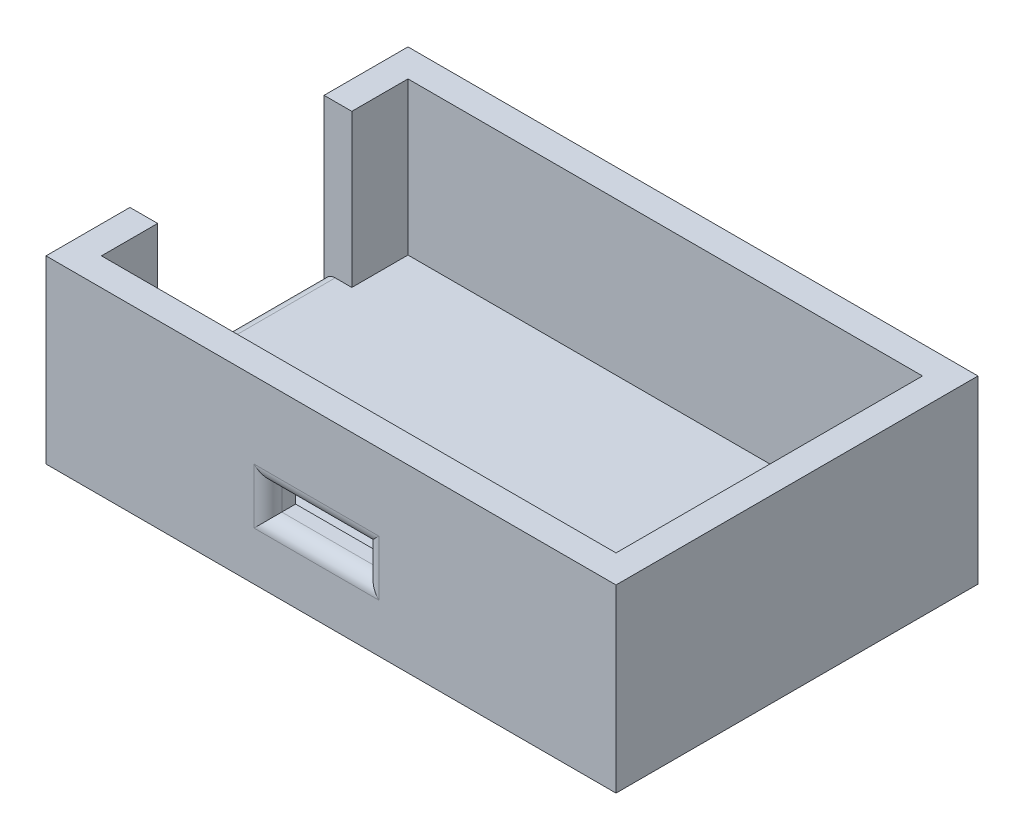
ISO-10303-21;
HEADER;
FILE_DESCRIPTION(('STEP AP214'),'2;1');
FILE_NAME('part.step','',(''),(''),'','','');
FILE_SCHEMA(('AUTOMOTIVE_DESIGN { 1 0 10303 214 1 1 1 1 }'));
ENDSEC;
DATA;
#1=APPLICATION_CONTEXT('core data for automotive mechanical design processes');
#2=APPLICATION_PROTOCOL_DEFINITION('international standard','automotive_design',2000,#1);
#3=PRODUCT_CONTEXT('',#1,'mechanical');
#4=PRODUCT('Part','Part','',(#3));
#5=PRODUCT_RELATED_PRODUCT_CATEGORY('part','',(#4));
#6=PRODUCT_DEFINITION_FORMATION('','',#4);
#7=PRODUCT_DEFINITION_CONTEXT('part definition',#1,'design');
#8=PRODUCT_DEFINITION('design','',#6,#7);
#9=PRODUCT_DEFINITION_SHAPE('','',#8);
#10=(LENGTH_UNIT() NAMED_UNIT(*) SI_UNIT(.MILLI.,.METRE.));
#11=(NAMED_UNIT(*) PLANE_ANGLE_UNIT() SI_UNIT($,.RADIAN.));
#12=(NAMED_UNIT(*) SI_UNIT($,.STERADIAN.) SOLID_ANGLE_UNIT());
#13=UNCERTAINTY_MEASURE_WITH_UNIT(LENGTH_MEASURE(1.E-05),#10,'distance_accuracy_value','');
#14=(GEOMETRIC_REPRESENTATION_CONTEXT(3) GLOBAL_UNCERTAINTY_ASSIGNED_CONTEXT((#13)) GLOBAL_UNIT_ASSIGNED_CONTEXT((#10,
#11,#12)) REPRESENTATION_CONTEXT('',''));
#15=CARTESIAN_POINT('',(0.,0.,0.));
#16=DIRECTION('',(0.,0.,1.));
#17=DIRECTION('',(1.,0.,0.));
#18=AXIS2_PLACEMENT_3D('',#15,#16,#17);
#19=CARTESIAN_POINT('',(-18.55,11.,-11.05));
#20=DIRECTION('',(1.,0.,0.));
#21=DIRECTION('',(0.,0.,-1.));
#22=AXIS2_PLACEMENT_3D('',#19,#20,#21);
#23=PLANE('',#22);
#24=DIRECTION('',(0.,-1.,0.));
#25=VECTOR('',#24,1.);
#26=CARTESIAN_POINT('',(-18.55,11.,-7.));
#27=LINE('',#26,#25);
#28=CARTESIAN_POINT('',(-18.55,11.,-7.));
#29=VERTEX_POINT('',#28);
#30=CARTESIAN_POINT('',(-18.55,0.,-7.));
#31=VERTEX_POINT('',#30);
#32=EDGE_CURVE('E213',#29,#31,#27,.T.);
#33=ORIENTED_EDGE('',*,*,#32,.T.);
#34=DIRECTION('',(0.,0.,1.));
#35=VECTOR('',#34,1.);
#36=CARTESIAN_POINT('',(-18.55,0.,-11.05));
#37=LINE('',#36,#35);
#38=CARTESIAN_POINT('',(-18.55,0.,-11.05));
#39=VERTEX_POINT('',#38);
#40=EDGE_CURVE('E237',#39,#31,#37,.T.);
#41=ORIENTED_EDGE('',*,*,#40,.F.);
#42=DIRECTION('',(0.,-1.,0.));
#43=VECTOR('',#42,1.);
#44=CARTESIAN_POINT('',(-18.55,11.,-11.05));
#45=LINE('',#44,#43);
#46=CARTESIAN_POINT('',(-18.55,11.,-11.05));
#47=VERTEX_POINT('',#46);
#48=EDGE_CURVE('E236',#47,#39,#45,.T.);
#49=ORIENTED_EDGE('',*,*,#48,.F.);
#50=DIRECTION('',(0.,0.,1.));
#51=VECTOR('',#50,1.);
#52=CARTESIAN_POINT('',(-18.55,11.,-11.05));
#53=LINE('',#52,#51);
#54=EDGE_CURVE('E225',#47,#29,#53,.T.);
#55=ORIENTED_EDGE('',*,*,#54,.T.);
#56=EDGE_LOOP('',(#33,#41,#49,#55));
#57=FACE_BOUND('',#56,.T.);
#58=ADVANCED_FACE('F36',(#57),#23,.T.);
#59=CARTESIAN_POINT('',(0.,11.,0.));
#60=DIRECTION('',(0.,-1.,0.));
#61=DIRECTION('',(0.,0.,-1.));
#62=AXIS2_PLACEMENT_3D('',#59,#60,#61);
#63=PLANE('',#62);
#64=DIRECTION('',(0.,0.,1.));
#65=VECTOR('',#64,1.);
#66=CARTESIAN_POINT('',(-20.55,11.,0.));
#67=LINE('',#66,#65);
#68=CARTESIAN_POINT('',(-20.55,11.,-13.05));
#69=VERTEX_POINT('',#68);
#70=CARTESIAN_POINT('',(-20.55,11.,-7.));
#71=VERTEX_POINT('',#70);
#72=EDGE_CURVE('E281',#69,#71,#67,.T.);
#73=ORIENTED_EDGE('',*,*,#72,.T.);
#74=DIRECTION('',(-1.,0.,0.));
#75=VECTOR('',#74,1.);
#76=CARTESIAN_POINT('',(-0.74550618523514,11.,-7.));
#77=LINE('',#76,#75);
#78=EDGE_CURVE('E206',#29,#71,#77,.T.);
#79=ORIENTED_EDGE('',*,*,#78,.F.);
#80=ORIENTED_EDGE('',*,*,#54,.F.);
#81=DIRECTION('',(-1.,0.,0.));
#82=VECTOR('',#81,1.);
#83=CARTESIAN_POINT('',(18.55,11.,-11.05));
#84=LINE('',#83,#82);
#85=CARTESIAN_POINT('',(18.55,11.,-11.05));
#86=VERTEX_POINT('',#85);
#87=EDGE_CURVE('E234',#86,#47,#84,.T.);
#88=ORIENTED_EDGE('',*,*,#87,.F.);
#89=DIRECTION('',(0.,0.,-1.));
#90=VECTOR('',#89,1.);
#91=CARTESIAN_POINT('',(18.55,11.,-11.05));
#92=LINE('',#91,#90);
#93=CARTESIAN_POINT('',(18.55,11.,11.05));
#94=VERTEX_POINT('',#93);
#95=EDGE_CURVE('E231',#94,#86,#92,.T.);
#96=ORIENTED_EDGE('',*,*,#95,.F.);
#97=DIRECTION('',(1.,0.,0.));
#98=VECTOR('',#97,1.);
#99=CARTESIAN_POINT('',(18.55,11.,11.05));
#100=LINE('',#99,#98);
#101=CARTESIAN_POINT('',(-18.55,11.,11.05));
#102=VERTEX_POINT('',#101);
#103=EDGE_CURVE('E228',#102,#94,#100,.T.);
#104=ORIENTED_EDGE('',*,*,#103,.F.);
#105=CARTESIAN_POINT('',(-18.55,11.,7.));
#106=VERTEX_POINT('',#105);
#107=EDGE_CURVE('E229',#106,#102,#53,.T.);
#108=ORIENTED_EDGE('',*,*,#107,.F.);
#109=DIRECTION('',(-1.,0.,0.));
#110=VECTOR('',#109,1.);
#111=CARTESIAN_POINT('',(-0.74550618523514,11.,7.));
#112=LINE('',#111,#110);
#113=CARTESIAN_POINT('',(-20.55,11.,7.));
#114=VERTEX_POINT('',#113);
#115=EDGE_CURVE('E211',#106,#114,#112,.T.);
#116=ORIENTED_EDGE('',*,*,#115,.T.);
#117=CARTESIAN_POINT('',(-20.55,11.,13.05));
#118=VERTEX_POINT('',#117);
#119=EDGE_CURVE('E280',#114,#118,#67,.T.);
#120=ORIENTED_EDGE('',*,*,#119,.T.);
#121=DIRECTION('',(1.,0.,0.));
#122=VECTOR('',#121,1.);
#123=CARTESIAN_POINT('',(0.,11.,13.05));
#124=LINE('',#123,#122);
#125=CARTESIAN_POINT('',(20.55,11.,13.05));
#126=VERTEX_POINT('',#125);
#127=EDGE_CURVE('E284',#118,#126,#124,.T.);
#128=ORIENTED_EDGE('',*,*,#127,.T.);
#129=DIRECTION('',(0.,0.,-1.));
#130=VECTOR('',#129,1.);
#131=CARTESIAN_POINT('',(20.55,11.,0.));
#132=LINE('',#131,#130);
#133=CARTESIAN_POINT('',(20.55,11.,-13.05));
#134=VERTEX_POINT('',#133);
#135=EDGE_CURVE('E286',#126,#134,#132,.T.);
#136=ORIENTED_EDGE('',*,*,#135,.T.);
#137=DIRECTION('',(-1.,0.,0.));
#138=VECTOR('',#137,1.);
#139=CARTESIAN_POINT('',(0.,11.,-13.05));
#140=LINE('',#139,#138);
#141=EDGE_CURVE('E270',#134,#69,#140,.T.);
#142=ORIENTED_EDGE('',*,*,#141,.T.);
#143=EDGE_LOOP('',(#73,#79,#80,#88,#96,#104,#108,#116,#120,#128,#136,#142));
#144=FACE_BOUND('',#143,.T.);
#145=ADVANCED_FACE('F326',(#144),#63,.F.);
#146=CARTESIAN_POINT('',(-20.55,11.,-11.05));
#147=DIRECTION('',(1.,0.,0.));
#148=DIRECTION('',(0.,0.,-1.));
#149=AXIS2_PLACEMENT_3D('',#146,#147,#148);
#150=PLANE('',#149);
#151=DIRECTION('',(0.,1.,0.));
#152=VECTOR('',#151,1.);
#153=CARTESIAN_POINT('',(-20.55,11.,7.));
#154=LINE('',#153,#152);
#155=CARTESIAN_POINT('',(-20.55,-0.8,7.));
#156=VERTEX_POINT('',#155);
#157=EDGE_CURVE('E51',#156,#114,#154,.T.);
#158=ORIENTED_EDGE('',*,*,#157,.F.);
#159=DIRECTION('',(0.,0.,1.));
#160=VECTOR('',#159,1.);
#161=CARTESIAN_POINT('',(-20.55,-0.8,-11.05));
#162=LINE('',#161,#160);
#163=CARTESIAN_POINT('',(-20.55,-0.8,-7.));
#164=VERTEX_POINT('',#163);
#165=EDGE_CURVE('E314',#156,#164,#162,.F.);
#166=ORIENTED_EDGE('',*,*,#165,.T.);
#167=DIRECTION('',(0.,-1.,0.));
#168=VECTOR('',#167,1.);
#169=CARTESIAN_POINT('',(-20.55,11.,-7.));
#170=LINE('',#169,#168);
#171=EDGE_CURVE('E58',#71,#164,#170,.T.);
#172=ORIENTED_EDGE('',*,*,#171,.F.);
#173=ORIENTED_EDGE('',*,*,#72,.F.);
#174=DIRECTION('',(0.,-1.,0.));
#175=VECTOR('',#174,1.);
#176=CARTESIAN_POINT('',(-20.55,11.,-13.05));
#177=LINE('',#176,#175);
#178=CARTESIAN_POINT('',(-20.55,-2.,-13.05));
#179=VERTEX_POINT('',#178);
#180=EDGE_CURVE('E266',#69,#179,#177,.T.);
#181=ORIENTED_EDGE('',*,*,#180,.T.);
#182=DIRECTION('',(0.,0.,1.));
#183=VECTOR('',#182,1.);
#184=CARTESIAN_POINT('',(-20.55,-2.,0.));
#185=LINE('',#184,#183);
#186=CARTESIAN_POINT('',(-20.55,-2.,13.05));
#187=VERTEX_POINT('',#186);
#188=EDGE_CURVE('E257',#179,#187,#185,.T.);
#189=ORIENTED_EDGE('',*,*,#188,.T.);
#190=DIRECTION('',(0.,-1.,0.));
#191=VECTOR('',#190,1.);
#192=CARTESIAN_POINT('',(-20.55,11.,13.05));
#193=LINE('',#192,#191);
#194=EDGE_CURVE('E261',#118,#187,#193,.T.);
#195=ORIENTED_EDGE('',*,*,#194,.F.);
#196=ORIENTED_EDGE('',*,*,#119,.F.);
#197=EDGE_LOOP('',(#158,#166,#172,#173,#181,#189,#195,#196));
#198=FACE_BOUND('',#197,.T.);
#199=ADVANCED_FACE('F322',(#198),#150,.F.);
#200=CARTESIAN_POINT('',(18.55,11.,13.05));
#201=DIRECTION('',(0.,0.,-1.));
#202=DIRECTION('',(-1.,0.,0.));
#203=AXIS2_PLACEMENT_3D('',#200,#201,#202);
#204=PLANE('',#203);
#205=DIRECTION('',(1.,0.,0.));
#206=VECTOR('',#205,1.);
#207=CARTESIAN_POINT('',(18.55,1.5,13.05));
#208=LINE('',#207,#206);
#209=CARTESIAN_POINT('',(3.45,1.5,13.05));
#210=VERTEX_POINT('',#209);
#211=CARTESIAN_POINT('',(-5.55,1.5,13.05));
#212=VERTEX_POINT('',#211);
#213=EDGE_CURVE('E291',#210,#212,#208,.F.);
#214=ORIENTED_EDGE('',*,*,#213,.T.);
#215=DIRECTION('',(0.,-1.,0.));
#216=VECTOR('',#215,1.);
#217=CARTESIAN_POINT('',(-5.55,11.,13.05));
#218=LINE('',#217,#216);
#219=CARTESIAN_POINT('',(-5.55,5.5,13.05));
#220=VERTEX_POINT('',#219);
#221=EDGE_CURVE('E297',#212,#220,#218,.F.);
#222=ORIENTED_EDGE('',*,*,#221,.T.);
#223=DIRECTION('',(-1.,0.,0.));
#224=VECTOR('',#223,1.);
#225=CARTESIAN_POINT('',(18.55,5.5,13.05));
#226=LINE('',#225,#224);
#227=CARTESIAN_POINT('',(3.45,5.5,13.05));
#228=VERTEX_POINT('',#227);
#229=EDGE_CURVE('E295',#220,#228,#226,.F.);
#230=ORIENTED_EDGE('',*,*,#229,.T.);
#231=DIRECTION('',(0.,1.,0.));
#232=VECTOR('',#231,1.);
#233=CARTESIAN_POINT('',(3.45,11.,13.05));
#234=LINE('',#233,#232);
#235=EDGE_CURVE('E293',#228,#210,#234,.F.);
#236=ORIENTED_EDGE('',*,*,#235,.T.);
#237=EDGE_LOOP('',(#214,#222,#230,#236));
#238=FACE_BOUND('',#237,.T.);
#239=DIRECTION('',(1.,0.,0.));
#240=VECTOR('',#239,1.);
#241=CARTESIAN_POINT('',(0.,-2.,13.05));
#242=LINE('',#241,#240);
#243=CARTESIAN_POINT('',(20.55,-2.,13.05));
#244=VERTEX_POINT('',#243);
#245=EDGE_CURVE('E260',#187,#244,#242,.T.);
#246=ORIENTED_EDGE('',*,*,#245,.T.);
#247=DIRECTION('',(0.,-1.,0.));
#248=VECTOR('',#247,1.);
#249=CARTESIAN_POINT('',(20.55,11.,13.05));
#250=LINE('',#249,#248);
#251=EDGE_CURVE('E265',#126,#244,#250,.T.);
#252=ORIENTED_EDGE('',*,*,#251,.F.);
#253=ORIENTED_EDGE('',*,*,#127,.F.);
#254=ORIENTED_EDGE('',*,*,#194,.T.);
#255=EDGE_LOOP('',(#246,#252,#253,#254));
#256=FACE_BOUND('',#255,.T.);
#257=ADVANCED_FACE('F343',(#238,#256),#204,.F.);
#258=CARTESIAN_POINT('',(20.55,11.,-11.05));
#259=DIRECTION('',(-1.,0.,0.));
#260=DIRECTION('',(0.,0.,1.));
#261=AXIS2_PLACEMENT_3D('',#258,#259,#260);
#262=PLANE('',#261);
#263=DIRECTION('',(0.,0.,-1.));
#264=VECTOR('',#263,1.);
#265=CARTESIAN_POINT('',(20.55,-2.,0.));
#266=LINE('',#265,#264);
#267=CARTESIAN_POINT('',(20.55,-2.,-13.05));
#268=VERTEX_POINT('',#267);
#269=EDGE_CURVE('E272',#244,#268,#266,.T.);
#270=ORIENTED_EDGE('',*,*,#269,.T.);
#271=DIRECTION('',(0.,-1.,0.));
#272=VECTOR('',#271,1.);
#273=CARTESIAN_POINT('',(20.55,11.,-13.05));
#274=LINE('',#273,#272);
#275=EDGE_CURVE('E269',#134,#268,#274,.T.);
#276=ORIENTED_EDGE('',*,*,#275,.F.);
#277=ORIENTED_EDGE('',*,*,#135,.F.);
#278=ORIENTED_EDGE('',*,*,#251,.T.);
#279=EDGE_LOOP('',(#270,#276,#277,#278));
#280=FACE_BOUND('',#279,.T.);
#281=ADVANCED_FACE('F390',(#280),#262,.F.);
#282=CARTESIAN_POINT('',(18.55,11.,-13.05));
#283=DIRECTION('',(0.,0.,1.));
#284=DIRECTION('',(1.,0.,0.));
#285=AXIS2_PLACEMENT_3D('',#282,#283,#284);
#286=PLANE('',#285);
#287=DIRECTION('',(-1.,0.,0.));
#288=VECTOR('',#287,1.);
#289=CARTESIAN_POINT('',(0.,-2.,-13.05));
#290=LINE('',#289,#288);
#291=EDGE_CURVE('E276',#268,#179,#290,.T.);
#292=ORIENTED_EDGE('',*,*,#291,.T.);
#293=ORIENTED_EDGE('',*,*,#180,.F.);
#294=ORIENTED_EDGE('',*,*,#141,.F.);
#295=ORIENTED_EDGE('',*,*,#275,.T.);
#296=EDGE_LOOP('',(#292,#293,#294,#295));
#297=FACE_BOUND('',#296,.T.);
#298=ADVANCED_FACE('F333',(#297),#286,.F.);
#299=CARTESIAN_POINT('',(0.,-2.,0.));
#300=DIRECTION('',(0.,-1.,0.));
#301=DIRECTION('',(0.,0.,-1.));
#302=AXIS2_PLACEMENT_3D('',#299,#300,#301);
#303=PLANE('',#302);
#304=ORIENTED_EDGE('',*,*,#188,.F.);
#305=ORIENTED_EDGE('',*,*,#291,.F.);
#306=ORIENTED_EDGE('',*,*,#269,.F.);
#307=ORIENTED_EDGE('',*,*,#245,.F.);
#308=EDGE_LOOP('',(#304,#305,#306,#307));
#309=FACE_BOUND('',#308,.T.);
#310=ADVANCED_FACE('F338',(#309),#303,.T.);
#311=DIRECTION('',(0.,1.,0.));
#312=VECTOR('',#311,1.);
#313=CARTESIAN_POINT('',(-18.55,11.,7.));
#314=LINE('',#313,#312);
#315=CARTESIAN_POINT('',(-18.55,0.,7.));
#316=VERTEX_POINT('',#315);
#317=EDGE_CURVE('E208',#316,#106,#314,.T.);
#318=ORIENTED_EDGE('',*,*,#317,.T.);
#319=ORIENTED_EDGE('',*,*,#107,.T.);
#320=DIRECTION('',(0.,-1.,0.));
#321=VECTOR('',#320,1.);
#322=CARTESIAN_POINT('',(-18.55,11.,11.05));
#323=LINE('',#322,#321);
#324=CARTESIAN_POINT('',(-18.55,0.,11.05));
#325=VERTEX_POINT('',#324);
#326=EDGE_CURVE('E254',#102,#325,#323,.T.);
#327=ORIENTED_EDGE('',*,*,#326,.T.);
#328=EDGE_CURVE('E224',#316,#325,#37,.T.);
#329=ORIENTED_EDGE('',*,*,#328,.F.);
#330=EDGE_LOOP('',(#318,#319,#327,#329));
#331=FACE_BOUND('',#330,.T.);
#332=ADVANCED_FACE('F348',(#331),#23,.T.);
#333=CARTESIAN_POINT('',(18.55,11.,11.05));
#334=DIRECTION('',(0.,0.,-1.));
#335=DIRECTION('',(-1.,0.,0.));
#336=AXIS2_PLACEMENT_3D('',#333,#334,#335);
#337=PLANE('',#336);
#338=DIRECTION('',(1.,0.,0.));
#339=VECTOR('',#338,1.);
#340=CARTESIAN_POINT('',(2.45,2.5,11.05));
#341=LINE('',#340,#339);
#342=CARTESIAN_POINT('',(-4.55,2.5,11.05));
#343=VERTEX_POINT('',#342);
#344=CARTESIAN_POINT('',(2.45,2.5,11.05));
#345=VERTEX_POINT('',#344);
#346=EDGE_CURVE('E182',#343,#345,#341,.T.);
#347=ORIENTED_EDGE('',*,*,#346,.T.);
#348=DIRECTION('',(0.,1.,0.));
#349=VECTOR('',#348,1.);
#350=CARTESIAN_POINT('',(2.45,4.5,11.05));
#351=LINE('',#350,#349);
#352=CARTESIAN_POINT('',(2.45,4.5,11.05));
#353=VERTEX_POINT('',#352);
#354=EDGE_CURVE('E167',#345,#353,#351,.T.);
#355=ORIENTED_EDGE('',*,*,#354,.T.);
#356=DIRECTION('',(-1.,0.,0.));
#357=VECTOR('',#356,1.);
#358=CARTESIAN_POINT('',(2.45,4.5,11.05));
#359=LINE('',#358,#357);
#360=CARTESIAN_POINT('',(-4.55,4.5,11.05));
#361=VERTEX_POINT('',#360);
#362=EDGE_CURVE('E199',#353,#361,#359,.T.);
#363=ORIENTED_EDGE('',*,*,#362,.T.);
#364=DIRECTION('',(0.,-1.,0.));
#365=VECTOR('',#364,1.);
#366=CARTESIAN_POINT('',(-4.55,4.5,11.05));
#367=LINE('',#366,#365);
#368=EDGE_CURVE('E189',#361,#343,#367,.T.);
#369=ORIENTED_EDGE('',*,*,#368,.T.);
#370=EDGE_LOOP('',(#347,#355,#363,#369));
#371=FACE_BOUND('',#370,.T.);
#372=DIRECTION('',(1.,0.,0.));
#373=VECTOR('',#372,1.);
#374=CARTESIAN_POINT('',(18.55,0.,11.05));
#375=LINE('',#374,#373);
#376=CARTESIAN_POINT('',(18.55,0.,11.05));
#377=VERTEX_POINT('',#376);
#378=EDGE_CURVE('E240',#325,#377,#375,.T.);
#379=ORIENTED_EDGE('',*,*,#378,.F.);
#380=ORIENTED_EDGE('',*,*,#326,.F.);
#381=ORIENTED_EDGE('',*,*,#103,.T.);
#382=DIRECTION('',(0.,-1.,0.));
#383=VECTOR('',#382,1.);
#384=CARTESIAN_POINT('',(18.55,11.,11.05));
#385=LINE('',#384,#383);
#386=EDGE_CURVE('E251',#94,#377,#385,.T.);
#387=ORIENTED_EDGE('',*,*,#386,.T.);
#388=EDGE_LOOP('',(#379,#380,#381,#387));
#389=FACE_BOUND('',#388,.T.);
#390=ADVANCED_FACE('F187',(#371,#389),#337,.T.);
#391=CARTESIAN_POINT('',(18.55,11.,-11.05));
#392=DIRECTION('',(-1.,0.,0.));
#393=DIRECTION('',(0.,0.,1.));
#394=AXIS2_PLACEMENT_3D('',#391,#392,#393);
#395=PLANE('',#394);
#396=DIRECTION('',(0.,0.,-1.));
#397=VECTOR('',#396,1.);
#398=CARTESIAN_POINT('',(18.55,0.,-11.05));
#399=LINE('',#398,#397);
#400=CARTESIAN_POINT('',(18.55,0.,-11.05));
#401=VERTEX_POINT('',#400);
#402=EDGE_CURVE('E242',#377,#401,#399,.T.);
#403=ORIENTED_EDGE('',*,*,#402,.F.);
#404=ORIENTED_EDGE('',*,*,#386,.F.);
#405=ORIENTED_EDGE('',*,*,#95,.T.);
#406=DIRECTION('',(0.,-1.,0.));
#407=VECTOR('',#406,1.);
#408=CARTESIAN_POINT('',(18.55,11.,-11.05));
#409=LINE('',#408,#407);
#410=EDGE_CURVE('E248',#86,#401,#409,.T.);
#411=ORIENTED_EDGE('',*,*,#410,.T.);
#412=EDGE_LOOP('',(#403,#404,#405,#411));
#413=FACE_BOUND('',#412,.T.);
#414=ADVANCED_FACE('F357',(#413),#395,.T.);
#415=CARTESIAN_POINT('',(18.55,11.,-11.05));
#416=DIRECTION('',(0.,0.,1.));
#417=DIRECTION('',(1.,0.,0.));
#418=AXIS2_PLACEMENT_3D('',#415,#416,#417);
#419=PLANE('',#418);
#420=DIRECTION('',(-1.,0.,0.));
#421=VECTOR('',#420,1.);
#422=CARTESIAN_POINT('',(18.55,0.,-11.05));
#423=LINE('',#422,#421);
#424=EDGE_CURVE('E244',#401,#39,#423,.T.);
#425=ORIENTED_EDGE('',*,*,#424,.F.);
#426=ORIENTED_EDGE('',*,*,#410,.F.);
#427=ORIENTED_EDGE('',*,*,#87,.T.);
#428=ORIENTED_EDGE('',*,*,#48,.T.);
#429=EDGE_LOOP('',(#425,#426,#427,#428));
#430=FACE_BOUND('',#429,.T.);
#431=ADVANCED_FACE('F362',(#430),#419,.T.);
#432=CARTESIAN_POINT('',(0.,0.,0.));
#433=DIRECTION('',(0.,-1.,0.));
#434=DIRECTION('',(0.,0.,-1.));
#435=AXIS2_PLACEMENT_3D('',#432,#433,#434);
#436=PLANE('',#435);
#437=DIRECTION('',(-1.,0.,0.));
#438=VECTOR('',#437,1.);
#439=CARTESIAN_POINT('',(-0.74550618523514,0.,-7.));
#440=LINE('',#439,#438);
#441=CARTESIAN_POINT('',(-19.75,0.,-7.));
#442=VERTEX_POINT('',#441);
#443=EDGE_CURVE('E216',#31,#442,#440,.T.);
#444=ORIENTED_EDGE('',*,*,#443,.T.);
#445=DIRECTION('',(0.,0.,1.));
#446=VECTOR('',#445,1.);
#447=CARTESIAN_POINT('',(-19.75,0.,0.));
#448=LINE('',#447,#446);
#449=CARTESIAN_POINT('',(-19.75,0.,7.));
#450=VERTEX_POINT('',#449);
#451=EDGE_CURVE('E305',#442,#450,#448,.T.);
#452=ORIENTED_EDGE('',*,*,#451,.T.);
#453=DIRECTION('',(-1.,0.,0.));
#454=VECTOR('',#453,1.);
#455=CARTESIAN_POINT('',(-0.74550618523514,0.,7.));
#456=LINE('',#455,#454);
#457=EDGE_CURVE('E212',#316,#450,#456,.T.);
#458=ORIENTED_EDGE('',*,*,#457,.F.);
#459=ORIENTED_EDGE('',*,*,#328,.T.);
#460=ORIENTED_EDGE('',*,*,#378,.T.);
#461=ORIENTED_EDGE('',*,*,#402,.T.);
#462=ORIENTED_EDGE('',*,*,#424,.T.);
#463=ORIENTED_EDGE('',*,*,#40,.T.);
#464=EDGE_LOOP('',(#444,#452,#458,#459,#460,#461,#462,#463));
#465=FACE_BOUND('',#464,.T.);
#466=ADVANCED_FACE('F352',(#465),#436,.F.);
#467=CARTESIAN_POINT('',(-0.74550618523514,11.,-7.));
#468=DIRECTION('',(0.,0.,-1.));
#469=DIRECTION('',(-1.,0.,0.));
#470=AXIS2_PLACEMENT_3D('',#467,#468,#469);
#471=PLANE('',#470);
#472=ORIENTED_EDGE('',*,*,#78,.T.);
#473=ORIENTED_EDGE('',*,*,#171,.T.);
#474=CARTESIAN_POINT('',(-19.75,-0.8,-7.));
#475=DIRECTION('',(0.,0.,-1.));
#476=DIRECTION('',(-1.,0.,0.));
#477=AXIS2_PLACEMENT_3D('',#474,#475,#476);
#478=CIRCLE('',#477,0.8);
#479=EDGE_CURVE('E11',#164,#442,#478,.T.);
#480=ORIENTED_EDGE('',*,*,#479,.T.);
#481=ORIENTED_EDGE('',*,*,#443,.F.);
#482=ORIENTED_EDGE('',*,*,#32,.F.);
#483=EDGE_LOOP('',(#472,#473,#480,#481,#482));
#484=FACE_BOUND('',#483,.T.);
#485=ADVANCED_FACE('F365',(#484),#471,.F.);
#486=CARTESIAN_POINT('',(-0.74550618523514,11.,7.));
#487=DIRECTION('',(0.,0.,1.));
#488=DIRECTION('',(0.,-1.,0.));
#489=AXIS2_PLACEMENT_3D('',#486,#487,#488);
#490=PLANE('',#489);
#491=ORIENTED_EDGE('',*,*,#457,.T.);
#492=CARTESIAN_POINT('',(-19.75,-0.8,7.));
#493=DIRECTION('',(0.,0.,1.));
#494=DIRECTION('',(0.,-1.,0.));
#495=AXIS2_PLACEMENT_3D('',#492,#493,#494);
#496=CIRCLE('',#495,0.8);
#497=EDGE_CURVE('E44',#450,#156,#496,.T.);
#498=ORIENTED_EDGE('',*,*,#497,.T.);
#499=ORIENTED_EDGE('',*,*,#157,.T.);
#500=ORIENTED_EDGE('',*,*,#115,.F.);
#501=ORIENTED_EDGE('',*,*,#317,.F.);
#502=EDGE_LOOP('',(#491,#498,#499,#500,#501));
#503=FACE_BOUND('',#502,.T.);
#504=ADVANCED_FACE('F317',(#503),#490,.F.);
#505=CARTESIAN_POINT('',(2.45,2.5,3.76989011071948));
#506=DIRECTION('',(0.,-1.,0.));
#507=DIRECTION('',(1.,0.,0.));
#508=AXIS2_PLACEMENT_3D('',#505,#506,#507);
#509=PLANE('',#508);
#510=DIRECTION('',(0.,0.,1.));
#511=VECTOR('',#510,1.);
#512=CARTESIAN_POINT('',(-4.55,2.5,3.76989011071948));
#513=LINE('',#512,#511);
#514=CARTESIAN_POINT('',(-4.55,2.5,12.05));
#515=VERTEX_POINT('',#514);
#516=EDGE_CURVE('E197',#343,#515,#513,.T.);
#517=ORIENTED_EDGE('',*,*,#516,.T.);
#518=DIRECTION('',(1.,0.,0.));
#519=VECTOR('',#518,1.);
#520=CARTESIAN_POINT('',(2.45,2.5,12.05));
#521=LINE('',#520,#519);
#522=CARTESIAN_POINT('',(2.45,2.5,12.05));
#523=VERTEX_POINT('',#522);
#524=EDGE_CURVE('E185',#515,#523,#521,.T.);
#525=ORIENTED_EDGE('',*,*,#524,.T.);
#526=DIRECTION('',(0.,0.,1.));
#527=VECTOR('',#526,1.);
#528=CARTESIAN_POINT('',(2.45,2.5,3.76989011071948));
#529=LINE('',#528,#527);
#530=EDGE_CURVE('E170',#345,#523,#529,.T.);
#531=ORIENTED_EDGE('',*,*,#530,.F.);
#532=ORIENTED_EDGE('',*,*,#346,.F.);
#533=EDGE_LOOP('',(#517,#525,#531,#532));
#534=FACE_BOUND('',#533,.T.);
#535=ADVANCED_FACE('F181',(#534),#509,.F.);
#536=CARTESIAN_POINT('',(2.45,4.5,3.76989011071948));
#537=DIRECTION('',(1.,0.,0.));
#538=DIRECTION('',(0.,1.,0.));
#539=AXIS2_PLACEMENT_3D('',#536,#537,#538);
#540=PLANE('',#539);
#541=ORIENTED_EDGE('',*,*,#530,.T.);
#542=DIRECTION('',(0.,1.,0.));
#543=VECTOR('',#542,1.);
#544=CARTESIAN_POINT('',(2.45,4.5,12.05));
#545=LINE('',#544,#543);
#546=CARTESIAN_POINT('',(2.45,4.5,12.05));
#547=VERTEX_POINT('',#546);
#548=EDGE_CURVE('E302',#523,#547,#545,.T.);
#549=ORIENTED_EDGE('',*,*,#548,.T.);
#550=DIRECTION('',(0.,0.,1.));
#551=VECTOR('',#550,1.);
#552=CARTESIAN_POINT('',(2.45,4.5,3.76989011071948));
#553=LINE('',#552,#551);
#554=EDGE_CURVE('E173',#353,#547,#553,.T.);
#555=ORIENTED_EDGE('',*,*,#554,.F.);
#556=ORIENTED_EDGE('',*,*,#354,.F.);
#557=EDGE_LOOP('',(#541,#549,#555,#556));
#558=FACE_BOUND('',#557,.T.);
#559=ADVANCED_FACE('F169',(#558),#540,.F.);
#560=CARTESIAN_POINT('',(2.45,4.5,3.76989011071948));
#561=DIRECTION('',(0.,1.,0.));
#562=DIRECTION('',(-1.,0.,0.));
#563=AXIS2_PLACEMENT_3D('',#560,#561,#562);
#564=PLANE('',#563);
#565=ORIENTED_EDGE('',*,*,#554,.T.);
#566=DIRECTION('',(-1.,0.,0.));
#567=VECTOR('',#566,1.);
#568=CARTESIAN_POINT('',(2.45,4.5,12.05));
#569=LINE('',#568,#567);
#570=CARTESIAN_POINT('',(-4.55,4.5,12.05));
#571=VERTEX_POINT('',#570);
#572=EDGE_CURVE('E300',#547,#571,#569,.T.);
#573=ORIENTED_EDGE('',*,*,#572,.T.);
#574=DIRECTION('',(0.,0.,1.));
#575=VECTOR('',#574,1.);
#576=CARTESIAN_POINT('',(-4.55,4.5,3.76989011071948));
#577=LINE('',#576,#575);
#578=EDGE_CURVE('E198',#361,#571,#577,.T.);
#579=ORIENTED_EDGE('',*,*,#578,.F.);
#580=ORIENTED_EDGE('',*,*,#362,.F.);
#581=EDGE_LOOP('',(#565,#573,#579,#580));
#582=FACE_BOUND('',#581,.T.);
#583=ADVANCED_FACE('F412',(#582),#564,.F.);
#584=CARTESIAN_POINT('',(-4.55,4.5,3.76989011071948));
#585=DIRECTION('',(-1.,0.,0.));
#586=DIRECTION('',(0.,-1.,0.));
#587=AXIS2_PLACEMENT_3D('',#584,#585,#586);
#588=PLANE('',#587);
#589=ORIENTED_EDGE('',*,*,#578,.T.);
#590=DIRECTION('',(0.,-1.,0.));
#591=VECTOR('',#590,1.);
#592=CARTESIAN_POINT('',(-4.55,4.5,12.05));
#593=LINE('',#592,#591);
#594=EDGE_CURVE('E264',#571,#515,#593,.T.);
#595=ORIENTED_EDGE('',*,*,#594,.T.);
#596=ORIENTED_EDGE('',*,*,#516,.F.);
#597=ORIENTED_EDGE('',*,*,#368,.F.);
#598=EDGE_LOOP('',(#589,#595,#596,#597));
#599=FACE_BOUND('',#598,.T.);
#600=ADVANCED_FACE('F407',(#599),#588,.F.);
#601=CARTESIAN_POINT('',(3.45,4.5,12.05));
#602=DIRECTION('',(0.,1.,0.));
#603=DIRECTION('',(-1.,0.,0.));
#604=AXIS2_PLACEMENT_3D('',#601,#602,#603);
#605=CYLINDRICAL_SURFACE('',#604,1.);
#606=CARTESIAN_POINT('',(3.45,1.5,12.05));
#607=DIRECTION('',(0.707106781186547,0.707106781186548,0.));
#608=DIRECTION('',(-0.707106781186548,0.707106781186547,0.));
#609=AXIS2_PLACEMENT_3D('',#606,#607,#608);
#610=ELLIPSE('',#609,1.4142135623731,1.);
#611=EDGE_CURVE('E193',#210,#523,#610,.F.);
#612=ORIENTED_EDGE('',*,*,#611,.F.);
#613=ORIENTED_EDGE('',*,*,#235,.F.);
#614=CARTESIAN_POINT('',(3.45,5.5,12.05));
#615=DIRECTION('',(-0.707106781186548,0.707106781186547,0.));
#616=DIRECTION('',(-0.707106781186547,-0.707106781186548,0.));
#617=AXIS2_PLACEMENT_3D('',#614,#615,#616);
#618=ELLIPSE('',#617,1.41421356237309,1.);
#619=EDGE_CURVE('E190',#547,#228,#618,.T.);
#620=ORIENTED_EDGE('',*,*,#619,.F.);
#621=ORIENTED_EDGE('',*,*,#548,.F.);
#622=EDGE_LOOP('',(#612,#613,#620,#621));
#623=FACE_BOUND('',#622,.T.);
#624=ADVANCED_FACE('F404',(#623),#605,.T.);
#625=CARTESIAN_POINT('',(2.45,5.5,12.05));
#626=DIRECTION('',(-1.,0.,0.));
#627=DIRECTION('',(0.,0.,1.));
#628=AXIS2_PLACEMENT_3D('',#625,#626,#627);
#629=CYLINDRICAL_SURFACE('',#628,1.);
#630=ORIENTED_EDGE('',*,*,#619,.T.);
#631=ORIENTED_EDGE('',*,*,#229,.F.);
#632=CARTESIAN_POINT('',(-5.55,5.5,12.05));
#633=DIRECTION('',(-0.707106781186548,-0.707106781186547,0.));
#634=DIRECTION('',(0.707106781186547,-0.707106781186548,0.));
#635=AXIS2_PLACEMENT_3D('',#632,#633,#634);
#636=ELLIPSE('',#635,1.41421356237309,1.);
#637=EDGE_CURVE('E308',#571,#220,#636,.T.);
#638=ORIENTED_EDGE('',*,*,#637,.F.);
#639=ORIENTED_EDGE('',*,*,#572,.F.);
#640=EDGE_LOOP('',(#630,#631,#638,#639));
#641=FACE_BOUND('',#640,.T.);
#642=ADVANCED_FACE('F401',(#641),#629,.T.);
#643=CARTESIAN_POINT('',(2.45,1.5,12.05));
#644=DIRECTION('',(1.,0.,0.));
#645=DIRECTION('',(0.,0.,-1.));
#646=AXIS2_PLACEMENT_3D('',#643,#644,#645);
#647=CYLINDRICAL_SURFACE('',#646,1.);
#648=ORIENTED_EDGE('',*,*,#611,.T.);
#649=ORIENTED_EDGE('',*,*,#524,.F.);
#650=CARTESIAN_POINT('',(-5.55,1.5,12.05));
#651=DIRECTION('',(0.707106781186547,-0.707106781186548,0.));
#652=DIRECTION('',(-0.707106781186548,-0.707106781186547,0.));
#653=AXIS2_PLACEMENT_3D('',#650,#651,#652);
#654=ELLIPSE('',#653,1.4142135623731,1.);
#655=EDGE_CURVE('E306',#212,#515,#654,.F.);
#656=ORIENTED_EDGE('',*,*,#655,.F.);
#657=ORIENTED_EDGE('',*,*,#213,.F.);
#658=EDGE_LOOP('',(#648,#649,#656,#657));
#659=FACE_BOUND('',#658,.T.);
#660=ADVANCED_FACE('F397',(#659),#647,.T.);
#661=CARTESIAN_POINT('',(-5.55,4.5,12.05));
#662=DIRECTION('',(0.,-1.,0.));
#663=DIRECTION('',(1.,0.,0.));
#664=AXIS2_PLACEMENT_3D('',#661,#662,#663);
#665=CYLINDRICAL_SURFACE('',#664,1.);
#666=ORIENTED_EDGE('',*,*,#637,.T.);
#667=ORIENTED_EDGE('',*,*,#221,.F.);
#668=ORIENTED_EDGE('',*,*,#655,.T.);
#669=ORIENTED_EDGE('',*,*,#594,.F.);
#670=EDGE_LOOP('',(#666,#667,#668,#669));
#671=FACE_BOUND('',#670,.T.);
#672=ADVANCED_FACE('F394',(#671),#665,.T.);
#673=CARTESIAN_POINT('',(-19.75,-0.8,0.));
#674=DIRECTION('',(0.,0.,1.));
#675=DIRECTION('',(1.,0.,0.));
#676=AXIS2_PLACEMENT_3D('',#673,#674,#675);
#677=CYLINDRICAL_SURFACE('',#676,0.8);
#678=ORIENTED_EDGE('',*,*,#479,.F.);
#679=ORIENTED_EDGE('',*,*,#165,.F.);
#680=ORIENTED_EDGE('',*,*,#497,.F.);
#681=ORIENTED_EDGE('',*,*,#451,.F.);
#682=EDGE_LOOP('',(#678,#679,#680,#681));
#683=FACE_BOUND('',#682,.T.);
#684=ADVANCED_FACE('F38',(#683),#677,.T.);
#685=CLOSED_SHELL('',(#58,#145,#199,#257,#281,#298,#310,#332,#390,#414,#431,#466,#485,#504,#535,
#559,#583,#600,#624,#642,#660,#672,#684));
#686=MANIFOLD_SOLID_BREP('B2',#685);
#687=ADVANCED_BREP_SHAPE_REPRESENTATION('',(#18,#686),#14);
#688=SHAPE_DEFINITION_REPRESENTATION(#9,#687);
ENDSEC;
END-ISO-10303-21;
